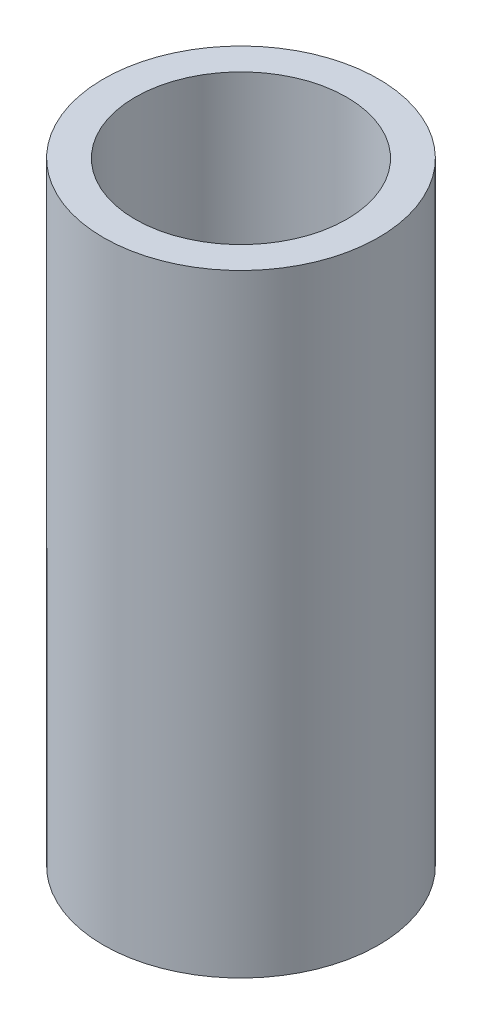
ISO-10303-21;
HEADER;
FILE_DESCRIPTION(('STEP AP214'),'2;1');
FILE_NAME('part.step','',(''),(''),'','','');
FILE_SCHEMA(('AUTOMOTIVE_DESIGN { 1 0 10303 214 1 1 1 1 }'));
ENDSEC;
DATA;
#1=APPLICATION_CONTEXT('core data for automotive mechanical design processes');
#2=APPLICATION_PROTOCOL_DEFINITION('international standard','automotive_design',2000,#1);
#3=PRODUCT_CONTEXT('',#1,'mechanical');
#4=PRODUCT('Part','Part','',(#3));
#5=PRODUCT_RELATED_PRODUCT_CATEGORY('part','',(#4));
#6=PRODUCT_DEFINITION_FORMATION('','',#4);
#7=PRODUCT_DEFINITION_CONTEXT('part definition',#1,'design');
#8=PRODUCT_DEFINITION('design','',#6,#7);
#9=PRODUCT_DEFINITION_SHAPE('','',#8);
#10=(LENGTH_UNIT() NAMED_UNIT(*) SI_UNIT(.MILLI.,.METRE.));
#11=(NAMED_UNIT(*) PLANE_ANGLE_UNIT() SI_UNIT($,.RADIAN.));
#12=(NAMED_UNIT(*) SI_UNIT($,.STERADIAN.) SOLID_ANGLE_UNIT());
#13=UNCERTAINTY_MEASURE_WITH_UNIT(LENGTH_MEASURE(1.E-05),#10,'distance_accuracy_value','');
#14=(GEOMETRIC_REPRESENTATION_CONTEXT(3) GLOBAL_UNCERTAINTY_ASSIGNED_CONTEXT((#13)) GLOBAL_UNIT_ASSIGNED_CONTEXT((#10,
#11,#12)) REPRESENTATION_CONTEXT('',''));
#15=CARTESIAN_POINT('',(0.,0.,0.));
#16=DIRECTION('',(0.,0.,1.));
#17=DIRECTION('',(1.,0.,0.));
#18=AXIS2_PLACEMENT_3D('',#15,#16,#17);
#19=CARTESIAN_POINT('',(0.,144.860870544118,0.));
#20=DIRECTION('',(0.,-1.,0.));
#21=DIRECTION('',(0.,0.,-1.));
#22=AXIS2_PLACEMENT_3D('',#19,#20,#21);
#23=CYLINDRICAL_SURFACE('',#22,32.5);
#24=CARTESIAN_POINT('',(0.,144.860870544118,0.));
#25=DIRECTION('',(0.,1.,0.));
#26=DIRECTION('',(0.,0.,1.));
#27=AXIS2_PLACEMENT_3D('',#24,#25,#26);
#28=CIRCLE('',#27,32.5);
#29=CARTESIAN_POINT('',(0.,144.860870544118,32.5));
#30=VERTEX_POINT('',#29);
#31=EDGE_CURVE('E10',#30,#30,#28,.T.);
#32=ORIENTED_EDGE('',*,*,#31,.F.);
#33=EDGE_LOOP('',(#32));
#34=FACE_BOUND('',#33,.T.);
#35=CARTESIAN_POINT('',(0.,0.,0.));
#36=DIRECTION('',(0.,1.,0.));
#37=DIRECTION('',(0.,0.,1.));
#38=AXIS2_PLACEMENT_3D('',#35,#36,#37);
#39=CIRCLE('',#38,32.5);
#40=CARTESIAN_POINT('',(0.,0.,32.5));
#41=VERTEX_POINT('',#40);
#42=EDGE_CURVE('E37',#41,#41,#39,.T.);
#43=ORIENTED_EDGE('',*,*,#42,.T.);
#44=EDGE_LOOP('',(#43));
#45=FACE_BOUND('',#44,.T.);
#46=ADVANCED_FACE('F40',(#34,#45),#23,.T.);
#47=CARTESIAN_POINT('',(0.,144.860870544118,0.));
#48=DIRECTION('',(0.,1.,0.));
#49=DIRECTION('',(0.,0.,1.));
#50=AXIS2_PLACEMENT_3D('',#47,#48,#49);
#51=PLANE('',#50);
#52=CARTESIAN_POINT('',(0.,144.860870544118,0.));
#53=DIRECTION('',(0.,1.,0.));
#54=DIRECTION('',(0.,0.,1.));
#55=AXIS2_PLACEMENT_3D('',#52,#53,#54);
#56=CIRCLE('',#55,25.0102399760599);
#57=CARTESIAN_POINT('',(0.,144.860870544118,25.0102399760599));
#58=VERTEX_POINT('',#57);
#59=EDGE_CURVE('E50',#58,#58,#56,.T.);
#60=ORIENTED_EDGE('',*,*,#59,.F.);
#61=EDGE_LOOP('',(#60));
#62=FACE_BOUND('',#61,.T.);
#63=ORIENTED_EDGE('',*,*,#31,.T.);
#64=EDGE_LOOP('',(#63));
#65=FACE_BOUND('',#64,.T.);
#66=ADVANCED_FACE('F59',(#62,#65),#51,.T.);
#67=CARTESIAN_POINT('',(0.,0.,0.));
#68=DIRECTION('',(0.,1.,0.));
#69=DIRECTION('',(0.,0.,1.));
#70=AXIS2_PLACEMENT_3D('',#67,#68,#69);
#71=PLANE('',#70);
#72=CARTESIAN_POINT('',(0.,0.,0.));
#73=DIRECTION('',(0.,1.,0.));
#74=DIRECTION('',(0.,0.,1.));
#75=AXIS2_PLACEMENT_3D('',#72,#73,#74);
#76=CIRCLE('',#75,25.0102399760599);
#77=CARTESIAN_POINT('',(0.,0.,25.0102399760599));
#78=VERTEX_POINT('',#77);
#79=EDGE_CURVE('E47',#78,#78,#76,.T.);
#80=ORIENTED_EDGE('',*,*,#79,.T.);
#81=EDGE_LOOP('',(#80));
#82=FACE_BOUND('',#81,.T.);
#83=ORIENTED_EDGE('',*,*,#42,.F.);
#84=EDGE_LOOP('',(#83));
#85=FACE_BOUND('',#84,.T.);
#86=ADVANCED_FACE('F58',(#82,#85),#71,.F.);
#87=CARTESIAN_POINT('',(0.,144.860870544118,0.));
#88=DIRECTION('',(0.,-1.,0.));
#89=DIRECTION('',(0.,0.,-1.));
#90=AXIS2_PLACEMENT_3D('',#87,#88,#89);
#91=CYLINDRICAL_SURFACE('',#90,25.0102399760599);
#92=ORIENTED_EDGE('',*,*,#59,.T.);
#93=EDGE_LOOP('',(#92));
#94=FACE_BOUND('',#93,.T.);
#95=ORIENTED_EDGE('',*,*,#79,.F.);
#96=EDGE_LOOP('',(#95));
#97=FACE_BOUND('',#96,.T.);
#98=ADVANCED_FACE('F54',(#94,#97),#91,.F.);
#99=CLOSED_SHELL('',(#46,#66,#86,#98));
#100=MANIFOLD_SOLID_BREP('B2',#99);
#101=ADVANCED_BREP_SHAPE_REPRESENTATION('',(#18,#100),#14);
#102=SHAPE_DEFINITION_REPRESENTATION(#9,#101);
ENDSEC;
END-ISO-10303-21;
